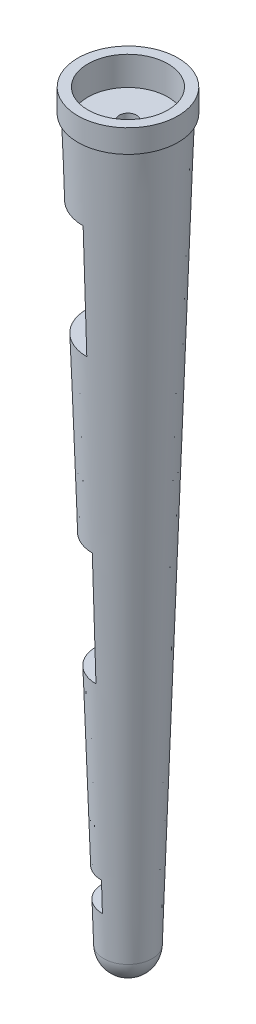
ISO-10303-21;
HEADER;
FILE_DESCRIPTION(('STEP AP214'),'2;1');
FILE_NAME('part.step','',(''),(''),'','','');
FILE_SCHEMA(('AUTOMOTIVE_DESIGN { 1 0 10303 214 1 1 1 1 }'));
ENDSEC;
DATA;
#1=APPLICATION_CONTEXT('core data for automotive mechanical design processes');
#2=APPLICATION_PROTOCOL_DEFINITION('international standard','automotive_design',2000,#1);
#3=PRODUCT_CONTEXT('',#1,'mechanical');
#4=PRODUCT('Part','Part','',(#3));
#5=PRODUCT_RELATED_PRODUCT_CATEGORY('part','',(#4));
#6=PRODUCT_DEFINITION_FORMATION('','',#4);
#7=PRODUCT_DEFINITION_CONTEXT('part definition',#1,'design');
#8=PRODUCT_DEFINITION('design','',#6,#7);
#9=PRODUCT_DEFINITION_SHAPE('','',#8);
#10=(LENGTH_UNIT() NAMED_UNIT(*) SI_UNIT(.MILLI.,.METRE.));
#11=(NAMED_UNIT(*) PLANE_ANGLE_UNIT() SI_UNIT($,.RADIAN.));
#12=(NAMED_UNIT(*) SI_UNIT($,.STERADIAN.) SOLID_ANGLE_UNIT());
#13=UNCERTAINTY_MEASURE_WITH_UNIT(LENGTH_MEASURE(1.E-05),#10,'distance_accuracy_value','');
#14=(GEOMETRIC_REPRESENTATION_CONTEXT(3) GLOBAL_UNCERTAINTY_ASSIGNED_CONTEXT((#13)) GLOBAL_UNIT_ASSIGNED_CONTEXT((#10,
#11,#12)) REPRESENTATION_CONTEXT('',''));
#15=CARTESIAN_POINT('',(0.,0.,0.));
#16=DIRECTION('',(0.,0.,1.));
#17=DIRECTION('',(1.,0.,0.));
#18=AXIS2_PLACEMENT_3D('',#15,#16,#17);
#19=CARTESIAN_POINT('',(0.,0.,0.));
#20=DIRECTION('',(1.,0.,0.));
#21=DIRECTION('',(0.,0.,-1.));
#22=AXIS2_PLACEMENT_3D('',#19,#20,#21);
#23=PLANE('',#22);
#24=DIRECTION('',(0.,0.,-1.));
#25=VECTOR('',#24,1.);
#26=CARTESIAN_POINT('',(0.,-138.679543165146,0.));
#27=LINE('',#26,#25);
#28=CARTESIAN_POINT('',(0.,-138.679543165146,-1.905));
#29=VERTEX_POINT('',#28);
#30=CARTESIAN_POINT('',(0.,-138.679543165146,-3.65518659359779));
#31=VERTEX_POINT('',#30);
#32=EDGE_CURVE('E205',#29,#31,#27,.T.);
#33=ORIENTED_EDGE('',*,*,#32,.F.);
#34=DIRECTION('',(0.,1.,0.));
#35=VECTOR('',#34,1.);
#36=CARTESIAN_POINT('',(0.,-152.619264469482,-1.905));
#37=LINE('',#36,#35);
#38=CARTESIAN_POINT('',(0.,-132.189046243604,-1.905));
#39=VERTEX_POINT('',#38);
#40=EDGE_CURVE('E373',#29,#39,#37,.T.);
#41=ORIENTED_EDGE('',*,*,#40,.T.);
#42=DIRECTION('',(0.,0.,-1.));
#43=VECTOR('',#42,1.);
#44=CARTESIAN_POINT('',(0.,-132.189046243604,0.));
#45=LINE('',#44,#43);
#46=CARTESIAN_POINT('',(0.,-132.189046243604,-3.65518659359779));
#47=VERTEX_POINT('',#46);
#48=EDGE_CURVE('E208',#39,#47,#45,.T.);
#49=ORIENTED_EDGE('',*,*,#48,.T.);
#50=DIRECTION('',(0.,-1.,0.));
#51=VECTOR('',#50,1.);
#52=CARTESIAN_POINT('',(0.,0.,-3.6551865935978));
#53=LINE('',#52,#51);
#54=EDGE_CURVE('E204',#47,#31,#53,.T.);
#55=ORIENTED_EDGE('',*,*,#54,.T.);
#56=EDGE_LOOP('',(#33,#41,#49,#55));
#57=FACE_BOUND('',#56,.T.);
#58=ADVANCED_FACE('F38',(#57),#23,.F.);
#59=CARTESIAN_POINT('',(0.,0.,0.));
#60=DIRECTION('',(1.,0.,0.));
#61=DIRECTION('',(0.,0.,-1.));
#62=AXIS2_PLACEMENT_3D('',#59,#60,#61);
#63=PLANE('',#62);
#64=DIRECTION('',(0.,0.,-1.));
#65=VECTOR('',#64,1.);
#66=CARTESIAN_POINT('',(0.,-94.0890462436041,0.));
#67=LINE('',#66,#65);
#68=CARTESIAN_POINT('',(0.,-94.0890462436041,-1.905));
#69=VERTEX_POINT('',#68);
#70=CARTESIAN_POINT('',(0.,-94.0890462436041,-3.65518659359779));
#71=VERTEX_POINT('',#70);
#72=EDGE_CURVE('E191',#69,#71,#67,.T.);
#73=ORIENTED_EDGE('',*,*,#72,.F.);
#74=DIRECTION('',(0.,1.,0.));
#75=VECTOR('',#74,1.);
#76=CARTESIAN_POINT('',(0.,-152.619264469482,-1.905));
#77=LINE('',#76,#75);
#78=CARTESIAN_POINT('',(0.,-68.6890462436041,-1.905));
#79=VERTEX_POINT('',#78);
#80=EDGE_CURVE('E367',#69,#79,#77,.T.);
#81=ORIENTED_EDGE('',*,*,#80,.T.);
#82=DIRECTION('',(0.,0.,-1.));
#83=VECTOR('',#82,1.);
#84=CARTESIAN_POINT('',(0.,-68.6890462436041,0.));
#85=LINE('',#84,#83);
#86=CARTESIAN_POINT('',(0.,-68.6890462436041,-3.65518659359779));
#87=VERTEX_POINT('',#86);
#88=EDGE_CURVE('E186',#79,#87,#85,.T.);
#89=ORIENTED_EDGE('',*,*,#88,.T.);
#90=DIRECTION('',(0.,-1.,0.));
#91=VECTOR('',#90,1.);
#92=CARTESIAN_POINT('',(0.,0.,-3.6551865935978));
#93=LINE('',#92,#91);
#94=EDGE_CURVE('E183',#87,#71,#93,.T.);
#95=ORIENTED_EDGE('',*,*,#94,.T.);
#96=EDGE_LOOP('',(#73,#81,#89,#95));
#97=FACE_BOUND('',#96,.T.);
#98=ADVANCED_FACE('F276',(#97),#63,.F.);
#99=CARTESIAN_POINT('',(0.,0.,0.));
#100=DIRECTION('',(1.,0.,0.));
#101=DIRECTION('',(0.,0.,-1.));
#102=AXIS2_PLACEMENT_3D('',#99,#100,#101);
#103=PLANE('',#102);
#104=DIRECTION('',(0.,0.,-1.));
#105=VECTOR('',#104,1.);
#106=CARTESIAN_POINT('',(0.,-30.5890462436041,0.));
#107=LINE('',#106,#105);
#108=CARTESIAN_POINT('',(0.,-30.5890462436041,-1.905));
#109=VERTEX_POINT('',#108);
#110=CARTESIAN_POINT('',(0.,-30.5890462436041,-3.65518659359779));
#111=VERTEX_POINT('',#110);
#112=EDGE_CURVE('E169',#109,#111,#107,.T.);
#113=ORIENTED_EDGE('',*,*,#112,.F.);
#114=DIRECTION('',(0.,1.,0.));
#115=VECTOR('',#114,1.);
#116=CARTESIAN_POINT('',(0.,-152.619264469482,-1.905));
#117=LINE('',#116,#115);
#118=CARTESIAN_POINT('',(0.,-5.18904624360411,-1.905));
#119=VERTEX_POINT('',#118);
#120=EDGE_CURVE('E358',#109,#119,#117,.T.);
#121=ORIENTED_EDGE('',*,*,#120,.T.);
#122=DIRECTION('',(0.,0.,-1.));
#123=VECTOR('',#122,1.);
#124=CARTESIAN_POINT('',(0.,-5.18904624360411,0.));
#125=LINE('',#124,#123);
#126=CARTESIAN_POINT('',(0.,-5.18904624360411,-3.65518659359779));
#127=VERTEX_POINT('',#126);
#128=EDGE_CURVE('E164',#119,#127,#125,.T.);
#129=ORIENTED_EDGE('',*,*,#128,.T.);
#130=DIRECTION('',(0.,-1.,0.));
#131=VECTOR('',#130,1.);
#132=CARTESIAN_POINT('',(0.,0.,-3.65518659359779));
#133=LINE('',#132,#131);
#134=EDGE_CURVE('E173',#127,#111,#133,.T.);
#135=ORIENTED_EDGE('',*,*,#134,.T.);
#136=EDGE_LOOP('',(#113,#121,#129,#135));
#137=FACE_BOUND('',#136,.T.);
#138=ADVANCED_FACE('F281',(#137),#103,.F.);
#139=CARTESIAN_POINT('',(0.,11.3209537563959,0.));
#140=DIRECTION('',(0.,1.,0.));
#141=DIRECTION('',(-1.,0.,0.));
#142=AXIS2_PLACEMENT_3D('',#139,#140,#141);
#143=CONICAL_SURFACE('',#142,10.414,0.0318371302197097);
#144=CARTESIAN_POINT('',(0.,-147.429046243604,0.));
#145=DIRECTION('',(0.,1.,0.));
#146=DIRECTION('',(-1.,0.,0.));
#147=AXIS2_PLACEMENT_3D('',#144,#145,#146);
#148=CIRCLE('',#147,5.35814725324457);
#149=CARTESIAN_POINT('',(5.35814725324455,-147.429046243604,0.));
#150=VERTEX_POINT('',#149);
#151=EDGE_CURVE('E220',#150,#150,#148,.T.);
#152=ORIENTED_EDGE('',*,*,#151,.T.);
#153=EDGE_LOOP('',(#152));
#154=FACE_BOUND('',#153,.T.);
#155=CARTESIAN_POINT('',(0.,11.3209537563959,0.));
#156=DIRECTION('',(0.,1.,0.));
#157=DIRECTION('',(-1.,0.,0.));
#158=AXIS2_PLACEMENT_3D('',#155,#156,#157);
#159=CIRCLE('',#158,10.414);
#160=CARTESIAN_POINT('',(-10.414,11.3209537563959,0.));
#161=VERTEX_POINT('',#160);
#162=EDGE_CURVE('E225',#161,#161,#159,.T.);
#163=ORIENTED_EDGE('',*,*,#162,.F.);
#164=EDGE_LOOP('',(#163));
#165=FACE_BOUND('',#164,.T.);
#166=CARTESIAN_POINT('',(-3.76297765312588,-150.950763753856,-3.65518659359779));
#167=CARTESIAN_POINT('',(-3.83813672114551,-149.257711672612,-3.65518659359779));
#168=CARTESIAN_POINT('',(-3.91222848486919,-147.564612645051,-3.65518659359779));
#169=CARTESIAN_POINT('',(-4.05856806060973,-144.178336752723,-3.65518659359779));
#170=CARTESIAN_POINT('',(-4.1308158746951,-142.485159888046,-3.65518659359779));
#171=CARTESIAN_POINT('',(-4.34912865678696,-137.313159836536,-3.65518659359779));
#172=CARTESIAN_POINT('',(-4.49269216426769,-133.834231026097,-3.65518659359779));
#173=CARTESIAN_POINT('',(-4.70436820435346,-128.615685690882,-3.65518659359779));
#174=CARTESIAN_POINT('',(-4.77431543269389,-126.876143050672,-3.65518659359779));
#175=CARTESIAN_POINT('',(-4.91312686687736,-123.397015024012,-3.65518659359779));
#176=CARTESIAN_POINT('',(-4.98199107301823,-121.657429637574,-3.65518659359779));
#177=CARTESIAN_POINT('',(-5.05038384531122,-119.917825654894,-3.65518659359779));
#178=B_SPLINE_CURVE_WITH_KNOTS('',3,(#166,#167,#168,#169,#170,#171,#172,#173,#174,#175,#176,
#177),.UNSPECIFIED.,.F.,.F.,(4,2,2,2,2,4),(0.,5.0841575410137,10.1683093784881,20.6139730538796,
25.8368179528393,31.0596614155634),.UNSPECIFIED.);
#179=CARTESIAN_POINT('',(-4.29105238565613,-138.679543165146,-3.65518659359779));
#180=VERTEX_POINT('',#179);
#181=CARTESIAN_POINT('',(-4.55918959527502,-132.189046243604,-3.65518659359779));
#182=VERTEX_POINT('',#181);
#183=EDGE_CURVE('E233',#180,#182,#178,.T.);
#184=ORIENTED_EDGE('',*,*,#183,.T.);
#185=CARTESIAN_POINT('',(0.,-132.189046243604,0.));
#186=DIRECTION('',(0.,-1.,0.));
#187=DIRECTION('',(0.,0.,-1.));
#188=AXIS2_PLACEMENT_3D('',#185,#186,#187);
#189=CIRCLE('',#188,5.84350911693309);
#190=CARTESIAN_POINT('',(0.,-132.189046243604,5.84350911693309));
#191=VERTEX_POINT('',#190);
#192=EDGE_CURVE('E241',#182,#191,#189,.F.);
#193=ORIENTED_EDGE('',*,*,#192,.T.);
#194=DIRECTION('',(0.,-0.999493241376189,-0.0318317521245688));
#195=VECTOR('',#194,1.);
#196=CARTESIAN_POINT('',(0.,-315.6708679617,0.));
#197=LINE('',#196,#195);
#198=CARTESIAN_POINT('',(0.,-138.679543165146,5.63680047637508));
#199=VERTEX_POINT('',#198);
#200=EDGE_CURVE('E228',#199,#191,#197,.F.);
#201=ORIENTED_EDGE('',*,*,#200,.F.);
#202=CARTESIAN_POINT('',(0.,-138.679543165146,0.));
#203=DIRECTION('',(0.,-1.,0.));
#204=DIRECTION('',(0.,0.,-1.));
#205=AXIS2_PLACEMENT_3D('',#202,#203,#204);
#206=CIRCLE('',#205,5.63680047637508);
#207=EDGE_CURVE('E230',#180,#199,#206,.F.);
#208=ORIENTED_EDGE('',*,*,#207,.F.);
#209=EDGE_LOOP('',(#184,#193,#201,#208));
#210=FACE_BOUND('',#209,.T.);
#211=CARTESIAN_POINT('',(0.,-94.0890462436041,0.));
#212=DIRECTION('',(0.,-1.,0.));
#213=DIRECTION('',(0.,0.,-1.));
#214=AXIS2_PLACEMENT_3D('',#211,#212,#213);
#215=CIRCLE('',#214,7.05691377615439);
#216=CARTESIAN_POINT('',(-6.03652574003131,-94.0890462436041,-3.65518659359779));
#217=VERTEX_POINT('',#216);
#218=CARTESIAN_POINT('',(0.,-94.0890462436041,7.05691377615439));
#219=VERTEX_POINT('',#218);
#220=EDGE_CURVE('E313',#217,#219,#215,.F.);
#221=ORIENTED_EDGE('',*,*,#220,.F.);
#222=CARTESIAN_POINT('',(-4.98642119576789,-121.541229705642,-3.65518659359779));
#223=CARTESIAN_POINT('',(-5.06522459670013,-119.545488370762,-3.65518659359779));
#224=CARTESIAN_POINT('',(-5.14338512888148,-117.549721768195,-3.65518659359779));
#225=CARTESIAN_POINT('',(-5.29856761974877,-113.558144726367,-3.65518659359779));
#226=CARTESIAN_POINT('',(-5.37558957868659,-111.562334287117,-3.65518659359779));
#227=CARTESIAN_POINT('',(-5.6051685401313,-105.574842110261,-3.65518659359779));
#228=CARTESIAN_POINT('',(-5.75623847670861,-101.58310334091,-3.65518659359779));
#229=CARTESIAN_POINT('',(-6.05525314475554,-93.5995086490794,-3.65518659359779));
#230=CARTESIAN_POINT('',(-6.20319787590209,-89.6076527265868,-3.65518659359779));
#231=CARTESIAN_POINT('',(-6.64329137148165,-77.6319437326436,-3.65518659359779));
#232=CARTESIAN_POINT('',(-6.93169929655081,-69.6479531585042,-3.65518659359779));
#233=CARTESIAN_POINT('',(-7.33825397444553,-58.2593847624802,-3.65518659359779));
#234=CARTESIAN_POINT('',(-7.45917209920785,-54.8549052070016,-3.65518659359779));
#235=CARTESIAN_POINT('',(-7.6999249137618,-48.0459101867494,-3.65518659359779));
#236=CARTESIAN_POINT('',(-7.81975960431834,-44.6413947220027,-3.65518659359779));
#237=CARTESIAN_POINT('',(-7.93912681543483,-41.2368627815662,-3.65518659359779));
#238=B_SPLINE_CURVE_WITH_KNOTS('',3,(#222,#223,#224,#225,#226,#227,#228,#229,#230,#231,#232,
#233,#234,#235,#236,#237),.UNSPECIFIED.,.F.,.F.,(4,2,2,2,2,2,2,4),(0.,5.99188932305257,
11.9837773205002,23.9675648063484,35.9513535310251,59.9189421597625,70.1388207893392,
80.3586922032133),.UNSPECIFIED.);
#239=CARTESIAN_POINT('',(-6.96499896488091,-68.6890462436041,-3.65518659359779));
#240=VERTEX_POINT('',#239);
#241=EDGE_CURVE('E318',#217,#240,#238,.T.);
#242=ORIENTED_EDGE('',*,*,#241,.T.);
#243=CARTESIAN_POINT('',(0.,-68.6890462436041,0.));
#244=DIRECTION('',(0.,-1.,0.));
#245=DIRECTION('',(0.,0.,-1.));
#246=AXIS2_PLACEMENT_3D('',#243,#244,#245);
#247=CIRCLE('',#246,7.86585021563526);
#248=CARTESIAN_POINT('',(0.,-68.6890462436041,7.86585021563526));
#249=VERTEX_POINT('',#248);
#250=EDGE_CURVE('E308',#240,#249,#247,.F.);
#251=ORIENTED_EDGE('',*,*,#250,.T.);
#252=DIRECTION('',(0.,-0.999493241376189,-0.0318317521245688));
#253=VECTOR('',#252,1.);
#254=CARTESIAN_POINT('',(0.,-315.6708679617,0.));
#255=LINE('',#254,#253);
#256=EDGE_CURVE('E307',#219,#249,#255,.F.);
#257=ORIENTED_EDGE('',*,*,#256,.F.);
#258=EDGE_LOOP('',(#221,#242,#251,#257));
#259=FACE_BOUND('',#258,.T.);
#260=CARTESIAN_POINT('',(0.,-30.5890462436041,0.));
#261=DIRECTION('',(0.,-1.,0.));
#262=DIRECTION('',(0.,0.,-1.));
#263=AXIS2_PLACEMENT_3D('',#260,#261,#262);
#264=CIRCLE('',#263,9.07925487485656);
#265=CARTESIAN_POINT('',(-8.31098550405363,-30.5890462436041,-3.65518659359779));
#266=VERTEX_POINT('',#265);
#267=CARTESIAN_POINT('',(0.,-30.5890462436041,9.07925487485656));
#268=VERTEX_POINT('',#267);
#269=EDGE_CURVE('E47',#266,#268,#264,.F.);
#270=ORIENTED_EDGE('',*,*,#269,.F.);
#271=CARTESIAN_POINT('',(-7.3458145480753,-58.041229705642,-3.65518659359779));
#272=CARTESIAN_POINT('',(-7.44004293919151,-55.3922916495875,-3.65518659359779));
#273=CARTESIAN_POINT('',(-7.53391530327361,-52.7433409532208,-3.65518659359779));
#274=CARTESIAN_POINT('',(-7.72101705916545,-47.4454170739312,-3.65518659359779));
#275=CARTESIAN_POINT('',(-7.81424645102936,-44.7964438910101,-3.65518659359779));
#276=CARTESIAN_POINT('',(-8.09551070072181,-36.780039649243,-3.65518659359779));
#277=CARTESIAN_POINT('',(-8.28265445618378,-31.412577319073,-3.65518659359779));
#278=CARTESIAN_POINT('',(-8.65502471639328,-20.6775860460334,-3.65518659359779));
#279=CARTESIAN_POINT('',(-8.84025122107827,-15.3100571031616,-3.65518659359779));
#280=CARTESIAN_POINT('',(-9.20912105506264,-4.57494293087607,-3.65518659359779));
#281=CARTESIAN_POINT('',(-9.39276438379737,0.792642298557135,-3.65518659359779));
#282=CARTESIAN_POINT('',(-9.75871407251338,11.5278579584123,-3.65518659359779));
#283=CARTESIAN_POINT('',(-9.94102043259037,16.8954883888311,-3.65518659359779));
#284=CARTESIAN_POINT('',(-10.1227814582309,22.2631372184337,-3.65518659359779));
#285=B_SPLINE_CURVE_WITH_KNOTS('',3,(#271,#272,#273,#274,#275,#276,#277,#278,#279,#280,#281,
#282,#283,#284),.UNSPECIFIED.,.F.,.F.,(4,2,2,2,2,2,4),(0.,7.95184037443213,15.9036800788281,
32.015851152585,48.1280227518889,64.2402000974354,80.3523762892752),.UNSPECIFIED.);
#286=CARTESIAN_POINT('',(-9.18781467134167,-5.18904624360411,-3.65518659359779));
#287=VERTEX_POINT('',#286);
#288=EDGE_CURVE('E11',#266,#287,#285,.T.);
#289=ORIENTED_EDGE('',*,*,#288,.T.);
#290=CARTESIAN_POINT('',(0.,-5.18904624360411,0.));
#291=DIRECTION('',(0.,-1.,0.));
#292=DIRECTION('',(0.,0.,-1.));
#293=AXIS2_PLACEMENT_3D('',#290,#291,#292);
#294=CIRCLE('',#293,9.88819131433743);
#295=CARTESIAN_POINT('',(0.,-5.18904624360411,9.88819131433743));
#296=VERTEX_POINT('',#295);
#297=EDGE_CURVE('E349',#287,#296,#294,.F.);
#298=ORIENTED_EDGE('',*,*,#297,.T.);
#299=DIRECTION('',(0.,-0.999493241376189,-0.0318317521245688));
#300=VECTOR('',#299,1.);
#301=CARTESIAN_POINT('',(0.,-315.6708679617,0.));
#302=LINE('',#301,#300);
#303=EDGE_CURVE('E168',#268,#296,#302,.F.);
#304=ORIENTED_EDGE('',*,*,#303,.F.);
#305=EDGE_LOOP('',(#270,#289,#298,#304));
#306=FACE_BOUND('',#305,.T.);
#307=ADVANCED_FACE('F243',(#154,#165,#210,#259,#306),#143,.T.);
#308=CARTESIAN_POINT('',(0.,-147.258400552216,0.));
#309=DIRECTION('',(0.,1.,0.));
#310=DIRECTION('',(1.,0.,0.));
#311=AXIS2_PLACEMENT_3D('',#308,#309,#310);
#312=SPHERICAL_SURFACE('',#311,5.3608639172657);
#313=CARTESIAN_POINT('',(0.,-152.269372208436,0.));
#314=DIRECTION('',(0.,0.999999999999999,0.));
#315=DIRECTION('',(0.,0.,1.));
#316=AXIS2_PLACEMENT_3D('',#313,#314,#315);
#317=CIRCLE('',#316,1.905);
#318=CARTESIAN_POINT('',(1.90499999999998,-152.269372208436,0.));
#319=VERTEX_POINT('',#318);
#320=EDGE_CURVE('E376',#319,#319,#317,.T.);
#321=CARTESIAN_POINT('',(1.90499999999998,-152.269372208436,0.));
#322=CARTESIAN_POINT('',(1.9663672649229,-152.246043098662,0.));
#323=CARTESIAN_POINT('',(2.02730552628049,-152.221585629138,0.));
#324=CARTESIAN_POINT('',(2.14824279651466,-152.170449344007,0.));
#325=CARTESIAN_POINT('',(2.20824180539123,-152.1437705284,0.));
#326=CARTESIAN_POINT('',(2.32721932531301,-152.088226924519,0.));
#327=CARTESIAN_POINT('',(2.38619783635821,-152.059362136244,0.));
#328=CARTESIAN_POINT('',(2.50305483224659,-151.999485714055,0.));
#329=CARTESIAN_POINT('',(2.56093331708977,-151.96847408014,0.));
#330=CARTESIAN_POINT('',(2.67551212583634,-151.904345775931,0.));
#331=CARTESIAN_POINT('',(2.73221244973973,-151.871229105637,0.));
#332=CARTESIAN_POINT('',(2.844358416357,-151.802935436661,0.));
#333=CARTESIAN_POINT('',(2.89980405907088,-151.76775843798,0.));
#334=CARTESIAN_POINT('',(3.00936582990124,-151.695391585483,0.));
#335=CARTESIAN_POINT('',(3.06348195801771,-151.658201731667,0.));
#336=CARTESIAN_POINT('',(3.17031166237119,-151.581859362939,0.));
#337=CARTESIAN_POINT('',(3.22302523860819,-151.542706848027,0.));
#338=CARTESIAN_POINT('',(3.32697869440099,-151.462491998932,0.));
#339=CARTESIAN_POINT('',(3.37821857395679,-151.42142966475,0.));
#340=CARTESIAN_POINT('',(3.47915548068098,-151.337450596821,0.));
#341=CARTESIAN_POINT('',(3.52885250784937,-151.294533863075,0.));
#342=CARTESIAN_POINT('',(3.62663663636442,-151.206903918427,0.));
#343=CARTESIAN_POINT('',(3.67472373771109,-151.162190707526,0.));
#344=CARTESIAN_POINT('',(3.76922311398844,-151.07102815561,0.));
#345=CARTESIAN_POINT('',(3.81563538891913,-151.024578814595,0.));
#346=CARTESIAN_POINT('',(3.90672247219175,-150.930006692649,0.));
#347=CARTESIAN_POINT('',(3.95139728053368,-150.881883911717,0.));
#348=CARTESIAN_POINT('',(4.03894913542263,-150.784029858689,0.));
#349=CARTESIAN_POINT('',(4.08182618196965,-150.734298586592,0.));
#350=CARTESIAN_POINT('',(4.1657246444057,-150.633294670878,0.));
#351=CARTESIAN_POINT('',(4.20674606029473,-150.582022027262,0.));
#352=CARTESIAN_POINT('',(4.28687789699747,-150.478004568462,0.));
#353=CARTESIAN_POINT('',(4.32598831781119,-150.425259753278,0.));
#354=CARTESIAN_POINT('',(4.40224537911412,-150.318369138208,0.));
#355=CARTESIAN_POINT('',(4.43939201960334,-150.264223338322,0.));
#356=CARTESIAN_POINT('',(4.51167138541767,-150.154603831544,0.));
#357=CARTESIAN_POINT('',(4.54680411074279,-150.099130124654,0.));
#358=CARTESIAN_POINT('',(4.61500822946318,-149.986929673772,0.));
#359=CARTESIAN_POINT('',(4.64807962285846,-149.93020292978,0.));
#360=CARTESIAN_POINT('',(4.71211644302332,-149.815572965758,0.));
#361=CARTESIAN_POINT('',(4.7430818697929,-149.757669745727,0.));
#362=CARTESIAN_POINT('',(4.80286496432092,-149.640764978513,0.));
#363=CARTESIAN_POINT('',(4.83168263207937,-149.581763431331,0.));
#364=CARTESIAN_POINT('',(4.88713131491711,-149.462741641056,0.));
#365=CARTESIAN_POINT('',(4.91376232999641,-149.402721397964,0.));
#366=CARTESIAN_POINT('',(4.96480176501018,-149.28174322199,0.));
#367=CARTESIAN_POINT('',(4.98921018494466,-149.220785289109,0.));
#368=CARTESIAN_POINT('',(5.03577148694436,-149.09801400523,0.));
#369=CARTESIAN_POINT('',(5.05792436900957,-149.036200654232,0.));
#370=CARTESIAN_POINT('',(5.0999446966392,-148.911801960299,0.));
#371=CARTESIAN_POINT('',(5.11981214220362,-148.849216617363,0.));
#372=CARTESIAN_POINT('',(5.15723478305389,-148.72335840767,0.));
#373=CARTESIAN_POINT('',(5.17478997833975,-148.660085540913,0.));
#374=CARTESIAN_POINT('',(5.2075644243742,-148.532937679527,0.));
#375=CARTESIAN_POINT('',(5.22278367512279,-148.469062684899,0.));
#376=CARTESIAN_POINT('',(5.2508656950091,-148.340796776685,0.));
#377=CARTESIAN_POINT('',(5.26372846414681,-148.276405863101,0.));
#378=CARTESIAN_POINT('',(5.28708014741584,-148.147195021052,0.));
#379=CARTESIAN_POINT('',(5.29756906154715,-148.082375092587,0.));
#380=CARTESIAN_POINT('',(5.31615892774587,-147.952393708163,0.));
#381=CARTESIAN_POINT('',(5.32425987981329,-147.887232252203,0.));
#382=CARTESIAN_POINT('',(5.33806270458113,-147.756655745099,0.));
#383=CARTESIAN_POINT('',(5.34376457728157,-147.691240693956,0.));
#384=CARTESIAN_POINT('',(5.35276223405187,-147.560245330827,0.));
#385=CARTESIAN_POINT('',(5.35605801812174,-147.494665018841,0.));
#386=CARTESIAN_POINT('',(5.35814725324455,-147.429046243604,0.));
#387=B_SPLINE_CURVE_WITH_KNOTS('',3,(#321,#322,#323,#324,#325,#326,#327,#328,#329,#330,#331,
#332,#333,#334,#335,#336,#337,#338,#339,#340,#341,#342,#343,#344,#345,#346,#347,#348,#349,#350,
#351,#352,#353,#354,#355,#356,#357,#358,#359,#360,#361,#362,#363,#364,#365,#366,#367,#368,#369,
#370,#371,#372,#373,#374,#375,#376,#377,#378,#379,#380,#381,#382,#383,#384,#385,#386),
.UNSPECIFIED.,.F.,.F.,(4,2,2,2,2,2,2,2,2,2,2,2,2,2,2,2,2,2,2,2,2,2,2,2,2,2,2,2,2,2,2,2,4),(0.,
0.196944939753012,0.393889879506019,0.590834819259035,0.78777975901204,0.984724698765043,
1.18166963851806,1.37861457827106,1.57555951802408,1.77250445777709,1.96944939753008,
2.1663943372831,2.3633392770361,2.56028421678911,2.75722915654212,2.95417409629513,
3.15111903604813,3.34806397580114,3.54500891555416,3.74195385530715,3.93889879506018,
4.13584373481317,4.33278867456619,4.52973361431918,4.72667855407219,4.9236234938252,
5.12056843357821,5.31751337333122,5.51445831308422,5.71140325283725,5.90834819259026,
6.10529313234326,6.30223807209628),.UNSPECIFIED.);
#388=EDGE_CURVE('BSEAM40',#319,#150,#387,.T.);
#389=ORIENTED_EDGE('',*,*,#320,.T.);
#390=ORIENTED_EDGE('',*,*,#151,.F.);
#391=ORIENTED_EDGE('',*,*,#388,.T.);
#392=ORIENTED_EDGE('',*,*,#388,.F.);
#393=EDGE_LOOP('',(#389,#391,#390,#392));
#394=FACE_BOUND('',#393,.T.);
#395=ADVANCED_FACE('F40',(#394),#312,.T.);
#396=CARTESIAN_POINT('',(0.,16.4009537563959,0.));
#397=DIRECTION('',(0.,-1.,0.));
#398=DIRECTION('',(1.,0.,0.));
#399=AXIS2_PLACEMENT_3D('',#396,#397,#398);
#400=CYLINDRICAL_SURFACE('',#399,11.049);
#401=CARTESIAN_POINT('',(0.,16.4009537563959,0.));
#402=DIRECTION('',(0.,1.,0.));
#403=DIRECTION('',(0.,0.,1.));
#404=AXIS2_PLACEMENT_3D('',#401,#402,#403);
#405=CIRCLE('',#404,11.049);
#406=CARTESIAN_POINT('',(0.,16.4009537563959,11.049));
#407=VERTEX_POINT('',#406);
#408=EDGE_CURVE('E217',#407,#407,#405,.T.);
#409=ORIENTED_EDGE('',*,*,#408,.F.);
#410=EDGE_LOOP('',(#409));
#411=FACE_BOUND('',#410,.T.);
#412=CARTESIAN_POINT('',(0.,11.3209537563959,0.));
#413=DIRECTION('',(0.,1.,0.));
#414=DIRECTION('',(0.,0.,1.));
#415=AXIS2_PLACEMENT_3D('',#412,#413,#414);
#416=CIRCLE('',#415,11.049);
#417=CARTESIAN_POINT('',(0.,11.3209537563959,11.049));
#418=VERTEX_POINT('',#417);
#419=EDGE_CURVE('E181',#418,#418,#416,.T.);
#420=ORIENTED_EDGE('',*,*,#419,.T.);
#421=EDGE_LOOP('',(#420));
#422=FACE_BOUND('',#421,.T.);
#423=ADVANCED_FACE('F263',(#411,#422),#400,.T.);
#424=CARTESIAN_POINT('',(0.,16.4009537563959,0.));
#425=DIRECTION('',(0.,1.,0.));
#426=DIRECTION('',(0.,0.,1.));
#427=AXIS2_PLACEMENT_3D('',#424,#425,#426);
#428=PLANE('',#427);
#429=CARTESIAN_POINT('',(0.,16.4009537563959,0.));
#430=DIRECTION('',(0.,1.,0.));
#431=DIRECTION('',(0.,0.,1.));
#432=AXIS2_PLACEMENT_3D('',#429,#430,#431);
#433=CIRCLE('',#432,8.8265);
#434=CARTESIAN_POINT('',(0.,16.4009537563959,8.8265));
#435=VERTEX_POINT('',#434);
#436=EDGE_CURVE('E379',#435,#435,#433,.T.);
#437=ORIENTED_EDGE('',*,*,#436,.F.);
#438=EDGE_LOOP('',(#437));
#439=FACE_BOUND('',#438,.T.);
#440=ORIENTED_EDGE('',*,*,#408,.T.);
#441=EDGE_LOOP('',(#440));
#442=FACE_BOUND('',#441,.T.);
#443=ADVANCED_FACE('F259',(#439,#442),#428,.T.);
#444=CARTESIAN_POINT('',(0.,11.3209537563959,0.));
#445=DIRECTION('',(0.,1.,0.));
#446=DIRECTION('',(0.,0.,1.));
#447=AXIS2_PLACEMENT_3D('',#444,#445,#446);
#448=PLANE('',#447);
#449=ORIENTED_EDGE('',*,*,#162,.T.);
#450=EDGE_LOOP('',(#449));
#451=FACE_BOUND('',#450,.T.);
#452=ORIENTED_EDGE('',*,*,#419,.F.);
#453=EDGE_LOOP('',(#452));
#454=FACE_BOUND('',#453,.T.);
#455=ADVANCED_FACE('F262',(#451,#454),#448,.F.);
#456=CARTESIAN_POINT('',(-11.049,-132.189046243604,0.));
#457=DIRECTION('',(0.,-1.,0.));
#458=DIRECTION('',(0.,0.,-1.));
#459=AXIS2_PLACEMENT_3D('',#456,#457,#458);
#460=PLANE('',#459);
#461=CARTESIAN_POINT('',(0.,-132.189046243604,0.));
#462=DIRECTION('',(0.,-1.,0.));
#463=DIRECTION('',(0.,0.,-1.));
#464=AXIS2_PLACEMENT_3D('',#461,#462,#463);
#465=CIRCLE('',#464,1.905);
#466=CARTESIAN_POINT('',(0.,-132.189046243604,1.905));
#467=VERTEX_POINT('',#466);
#468=EDGE_CURVE('E303',#467,#39,#465,.T.);
#469=ORIENTED_EDGE('',*,*,#468,.F.);
#470=EDGE_CURVE('E209',#191,#467,#45,.T.);
#471=ORIENTED_EDGE('',*,*,#470,.F.);
#472=ORIENTED_EDGE('',*,*,#192,.F.);
#473=DIRECTION('',(1.,0.,0.));
#474=VECTOR('',#473,1.);
#475=CARTESIAN_POINT('',(-11.049,-132.189046243604,-3.65518659359779));
#476=LINE('',#475,#474);
#477=EDGE_CURVE('E187',#182,#47,#476,.T.);
#478=ORIENTED_EDGE('',*,*,#477,.T.);
#479=ORIENTED_EDGE('',*,*,#48,.F.);
#480=EDGE_LOOP('',(#469,#471,#472,#478,#479));
#481=FACE_BOUND('',#480,.T.);
#482=ADVANCED_FACE('F252',(#481),#460,.T.);
#483=CARTESIAN_POINT('',(-11.049,0.,-3.6551865935978));
#484=DIRECTION('',(0.,0.,1.));
#485=DIRECTION('',(0.,-1.,0.));
#486=AXIS2_PLACEMENT_3D('',#483,#484,#485);
#487=PLANE('',#486);
#488=DIRECTION('',(1.,0.,0.));
#489=VECTOR('',#488,1.);
#490=CARTESIAN_POINT('',(-11.049,-138.679543165146,-3.65518659359779));
#491=LINE('',#490,#489);
#492=EDGE_CURVE('E212',#180,#31,#491,.T.);
#493=ORIENTED_EDGE('',*,*,#492,.T.);
#494=ORIENTED_EDGE('',*,*,#54,.F.);
#495=ORIENTED_EDGE('',*,*,#477,.F.);
#496=ORIENTED_EDGE('',*,*,#183,.F.);
#497=EDGE_LOOP('',(#493,#494,#495,#496));
#498=FACE_BOUND('',#497,.T.);
#499=ADVANCED_FACE('F246',(#498),#487,.T.);
#500=CARTESIAN_POINT('',(-11.049,-138.679543165146,0.));
#501=DIRECTION('',(0.,-1.,0.));
#502=DIRECTION('',(0.,0.,-1.));
#503=AXIS2_PLACEMENT_3D('',#500,#501,#502);
#504=PLANE('',#503);
#505=CARTESIAN_POINT('',(0.,-138.679543165146,1.905));
#506=VERTEX_POINT('',#505);
#507=EDGE_CURVE('E201',#199,#506,#27,.T.);
#508=ORIENTED_EDGE('',*,*,#507,.T.);
#509=CARTESIAN_POINT('',(0.,-138.679543165146,0.));
#510=DIRECTION('',(0.,-1.,0.));
#511=DIRECTION('',(0.,0.,-1.));
#512=AXIS2_PLACEMENT_3D('',#509,#510,#511);
#513=CIRCLE('',#512,1.905);
#514=EDGE_CURVE('E54',#506,#29,#513,.T.);
#515=ORIENTED_EDGE('',*,*,#514,.T.);
#516=ORIENTED_EDGE('',*,*,#32,.T.);
#517=ORIENTED_EDGE('',*,*,#492,.F.);
#518=ORIENTED_EDGE('',*,*,#207,.T.);
#519=EDGE_LOOP('',(#508,#515,#516,#517,#518));
#520=FACE_BOUND('',#519,.T.);
#521=ADVANCED_FACE('F251',(#520),#504,.F.);
#522=ORIENTED_EDGE('',*,*,#470,.T.);
#523=DIRECTION('',(0.,1.,0.));
#524=VECTOR('',#523,1.);
#525=CARTESIAN_POINT('',(0.,-152.619264469482,1.905));
#526=LINE('',#525,#524);
#527=EDGE_CURVE('E296',#467,#506,#526,.F.);
#528=ORIENTED_EDGE('',*,*,#527,.T.);
#529=ORIENTED_EDGE('',*,*,#507,.F.);
#530=ORIENTED_EDGE('',*,*,#200,.T.);
#531=EDGE_LOOP('',(#522,#528,#529,#530));
#532=FACE_BOUND('',#531,.T.);
#533=ADVANCED_FACE('F257',(#532),#23,.F.);
#534=CARTESIAN_POINT('',(-11.049,0.,-3.6551865935978));
#535=DIRECTION('',(0.,0.,1.));
#536=DIRECTION('',(0.,-1.,0.));
#537=AXIS2_PLACEMENT_3D('',#534,#535,#536);
#538=PLANE('',#537);
#539=DIRECTION('',(1.,0.,0.));
#540=VECTOR('',#539,1.);
#541=CARTESIAN_POINT('',(-11.049,-94.0890462436041,-3.65518659359779));
#542=LINE('',#541,#540);
#543=EDGE_CURVE('E196',#217,#71,#542,.T.);
#544=ORIENTED_EDGE('',*,*,#543,.T.);
#545=ORIENTED_EDGE('',*,*,#94,.F.);
#546=DIRECTION('',(1.,0.,0.));
#547=VECTOR('',#546,1.);
#548=CARTESIAN_POINT('',(-11.049,-68.6890462436041,-3.65518659359779));
#549=LINE('',#548,#547);
#550=EDGE_CURVE('E195',#240,#87,#549,.T.);
#551=ORIENTED_EDGE('',*,*,#550,.F.);
#552=ORIENTED_EDGE('',*,*,#241,.F.);
#553=EDGE_LOOP('',(#544,#545,#551,#552));
#554=FACE_BOUND('',#553,.T.);
#555=ADVANCED_FACE('F288',(#554),#538,.T.);
#556=CARTESIAN_POINT('',(-11.049,-94.0890462436041,0.));
#557=DIRECTION('',(0.,-1.,0.));
#558=DIRECTION('',(0.,0.,-1.));
#559=AXIS2_PLACEMENT_3D('',#556,#557,#558);
#560=PLANE('',#559);
#561=CARTESIAN_POINT('',(0.,-94.0890462436041,1.905));
#562=VERTEX_POINT('',#561);
#563=EDGE_CURVE('E192',#219,#562,#67,.T.);
#564=ORIENTED_EDGE('',*,*,#563,.T.);
#565=CARTESIAN_POINT('',(0.,-94.0890462436041,0.));
#566=DIRECTION('',(0.,-1.,0.));
#567=DIRECTION('',(0.,0.,-1.));
#568=AXIS2_PLACEMENT_3D('',#565,#566,#567);
#569=CIRCLE('',#568,1.905);
#570=EDGE_CURVE('E62',#562,#69,#569,.T.);
#571=ORIENTED_EDGE('',*,*,#570,.T.);
#572=ORIENTED_EDGE('',*,*,#72,.T.);
#573=ORIENTED_EDGE('',*,*,#543,.F.);
#574=ORIENTED_EDGE('',*,*,#220,.T.);
#575=EDGE_LOOP('',(#564,#571,#572,#573,#574));
#576=FACE_BOUND('',#575,.T.);
#577=ADVANCED_FACE('F293',(#576),#560,.F.);
#578=CARTESIAN_POINT('',(-11.049,-68.6890462436041,0.));
#579=DIRECTION('',(0.,-1.,0.));
#580=DIRECTION('',(0.,0.,-1.));
#581=AXIS2_PLACEMENT_3D('',#578,#579,#580);
#582=PLANE('',#581);
#583=CARTESIAN_POINT('',(0.,-68.6890462436041,0.));
#584=DIRECTION('',(0.,-1.,0.));
#585=DIRECTION('',(0.,0.,-1.));
#586=AXIS2_PLACEMENT_3D('',#583,#584,#585);
#587=CIRCLE('',#586,1.905);
#588=CARTESIAN_POINT('',(0.,-68.6890462436041,1.905));
#589=VERTEX_POINT('',#588);
#590=EDGE_CURVE('E361',#589,#79,#587,.T.);
#591=ORIENTED_EDGE('',*,*,#590,.F.);
#592=EDGE_CURVE('E188',#249,#589,#85,.T.);
#593=ORIENTED_EDGE('',*,*,#592,.F.);
#594=ORIENTED_EDGE('',*,*,#250,.F.);
#595=ORIENTED_EDGE('',*,*,#550,.T.);
#596=ORIENTED_EDGE('',*,*,#88,.F.);
#597=EDGE_LOOP('',(#591,#593,#594,#595,#596));
#598=FACE_BOUND('',#597,.T.);
#599=ADVANCED_FACE('F328',(#598),#582,.T.);
#600=ORIENTED_EDGE('',*,*,#592,.T.);
#601=DIRECTION('',(0.,1.,0.));
#602=VECTOR('',#601,1.);
#603=CARTESIAN_POINT('',(0.,-152.619264469482,1.905));
#604=LINE('',#603,#602);
#605=EDGE_CURVE('E359',#589,#562,#604,.F.);
#606=ORIENTED_EDGE('',*,*,#605,.T.);
#607=ORIENTED_EDGE('',*,*,#563,.F.);
#608=ORIENTED_EDGE('',*,*,#256,.T.);
#609=EDGE_LOOP('',(#600,#606,#607,#608));
#610=FACE_BOUND('',#609,.T.);
#611=ADVANCED_FACE('F284',(#610),#63,.F.);
#612=CARTESIAN_POINT('',(-11.049,0.,-3.65518659359779));
#613=DIRECTION('',(0.,0.,1.));
#614=DIRECTION('',(0.,-1.,0.));
#615=AXIS2_PLACEMENT_3D('',#612,#613,#614);
#616=PLANE('',#615);
#617=DIRECTION('',(1.,0.,0.));
#618=VECTOR('',#617,1.);
#619=CARTESIAN_POINT('',(-11.049,-30.5890462436041,-3.65518659359779));
#620=LINE('',#619,#618);
#621=EDGE_CURVE('E178',#266,#111,#620,.T.);
#622=ORIENTED_EDGE('',*,*,#621,.T.);
#623=ORIENTED_EDGE('',*,*,#134,.F.);
#624=DIRECTION('',(1.,0.,0.));
#625=VECTOR('',#624,1.);
#626=CARTESIAN_POINT('',(-11.049,-5.18904624360411,-3.65518659359779));
#627=LINE('',#626,#625);
#628=EDGE_CURVE('E177',#287,#127,#627,.T.);
#629=ORIENTED_EDGE('',*,*,#628,.F.);
#630=ORIENTED_EDGE('',*,*,#288,.F.);
#631=EDGE_LOOP('',(#622,#623,#629,#630));
#632=FACE_BOUND('',#631,.T.);
#633=ADVANCED_FACE('F336',(#632),#616,.T.);
#634=CARTESIAN_POINT('',(-11.049,-30.5890462436041,0.));
#635=DIRECTION('',(0.,-1.,0.));
#636=DIRECTION('',(0.,0.,-1.));
#637=AXIS2_PLACEMENT_3D('',#634,#635,#636);
#638=PLANE('',#637);
#639=CARTESIAN_POINT('',(0.,-30.5890462436041,1.905));
#640=VERTEX_POINT('',#639);
#641=EDGE_CURVE('E171',#268,#640,#107,.T.);
#642=ORIENTED_EDGE('',*,*,#641,.T.);
#643=CARTESIAN_POINT('',(0.,-30.5890462436041,0.));
#644=DIRECTION('',(0.,-1.,0.));
#645=DIRECTION('',(0.,0.,-1.));
#646=AXIS2_PLACEMENT_3D('',#643,#644,#645);
#647=CIRCLE('',#646,1.905);
#648=EDGE_CURVE('E152',#640,#109,#647,.T.);
#649=ORIENTED_EDGE('',*,*,#648,.T.);
#650=ORIENTED_EDGE('',*,*,#112,.T.);
#651=ORIENTED_EDGE('',*,*,#621,.F.);
#652=ORIENTED_EDGE('',*,*,#269,.T.);
#653=EDGE_LOOP('',(#642,#649,#650,#651,#652));
#654=FACE_BOUND('',#653,.T.);
#655=ADVANCED_FACE('F340',(#654),#638,.F.);
#656=CARTESIAN_POINT('',(-11.049,-5.18904624360411,0.));
#657=DIRECTION('',(0.,-1.,0.));
#658=DIRECTION('',(0.,0.,-1.));
#659=AXIS2_PLACEMENT_3D('',#656,#657,#658);
#660=PLANE('',#659);
#661=CARTESIAN_POINT('',(0.,-5.18904624360411,0.));
#662=DIRECTION('',(0.,-1.,0.));
#663=DIRECTION('',(0.,0.,-1.));
#664=AXIS2_PLACEMENT_3D('',#661,#662,#663);
#665=CIRCLE('',#664,1.905);
#666=CARTESIAN_POINT('',(0.,-5.18904624360411,1.905));
#667=VERTEX_POINT('',#666);
#668=EDGE_CURVE('E149',#667,#119,#665,.T.);
#669=ORIENTED_EDGE('',*,*,#668,.F.);
#670=EDGE_CURVE('E161',#296,#667,#125,.T.);
#671=ORIENTED_EDGE('',*,*,#670,.F.);
#672=ORIENTED_EDGE('',*,*,#297,.F.);
#673=ORIENTED_EDGE('',*,*,#628,.T.);
#674=ORIENTED_EDGE('',*,*,#128,.F.);
#675=EDGE_LOOP('',(#669,#671,#672,#673,#674));
#676=FACE_BOUND('',#675,.T.);
#677=ADVANCED_FACE('F160',(#676),#660,.T.);
#678=ORIENTED_EDGE('',*,*,#670,.T.);
#679=DIRECTION('',(0.,1.,0.));
#680=VECTOR('',#679,1.);
#681=CARTESIAN_POINT('',(0.,-152.619264469482,1.905));
#682=LINE('',#681,#680);
#683=EDGE_CURVE('E145',#667,#640,#682,.F.);
#684=ORIENTED_EDGE('',*,*,#683,.T.);
#685=ORIENTED_EDGE('',*,*,#641,.F.);
#686=ORIENTED_EDGE('',*,*,#303,.T.);
#687=EDGE_LOOP('',(#678,#684,#685,#686));
#688=FACE_BOUND('',#687,.T.);
#689=ADVANCED_FACE('F166',(#688),#103,.F.);
#690=CARTESIAN_POINT('',(0.,10.0509537563959,0.));
#691=DIRECTION('',(0.,1.,0.));
#692=DIRECTION('',(0.,0.,1.));
#693=AXIS2_PLACEMENT_3D('',#690,#691,#692);
#694=CYLINDRICAL_SURFACE('',#693,8.8265);
#695=CARTESIAN_POINT('',(0.,10.0509537563959,0.));
#696=DIRECTION('',(0.,1.,0.));
#697=DIRECTION('',(0.,0.,1.));
#698=AXIS2_PLACEMENT_3D('',#695,#696,#697);
#699=CIRCLE('',#698,8.8265);
#700=CARTESIAN_POINT('',(0.,10.0509537563959,8.8265));
#701=VERTEX_POINT('',#700);
#702=EDGE_CURVE('E380',#701,#701,#699,.T.);
#703=ORIENTED_EDGE('',*,*,#702,.F.);
#704=EDGE_LOOP('',(#703));
#705=FACE_BOUND('',#704,.T.);
#706=ORIENTED_EDGE('',*,*,#436,.T.);
#707=EDGE_LOOP('',(#706));
#708=FACE_BOUND('',#707,.T.);
#709=ADVANCED_FACE('F385',(#705,#708),#694,.F.);
#710=CARTESIAN_POINT('',(0.,10.0509537563959,0.));
#711=DIRECTION('',(0.,1.,0.));
#712=DIRECTION('',(0.,0.,1.));
#713=AXIS2_PLACEMENT_3D('',#710,#711,#712);
#714=PLANE('',#713);
#715=CARTESIAN_POINT('',(0.,10.0509537563959,0.));
#716=DIRECTION('',(0.,1.,0.));
#717=DIRECTION('',(0.,0.,1.));
#718=AXIS2_PLACEMENT_3D('',#715,#716,#717);
#719=CIRCLE('',#718,1.905);
#720=CARTESIAN_POINT('',(0.,10.0509537563959,1.905));
#721=VERTEX_POINT('',#720);
#722=EDGE_CURVE('E42',#721,#721,#719,.T.);
#723=ORIENTED_EDGE('',*,*,#722,.F.);
#724=EDGE_LOOP('',(#723));
#725=FACE_BOUND('',#724,.T.);
#726=ORIENTED_EDGE('',*,*,#702,.T.);
#727=EDGE_LOOP('',(#726));
#728=FACE_BOUND('',#727,.T.);
#729=ADVANCED_FACE('F388',(#725,#728),#714,.T.);
#730=CARTESIAN_POINT('',(0.,-152.619264469482,0.));
#731=DIRECTION('',(0.,1.,0.));
#732=DIRECTION('',(0.,0.,1.));
#733=AXIS2_PLACEMENT_3D('',#730,#731,#732);
#734=CYLINDRICAL_SURFACE('',#733,1.905);
#735=ORIENTED_EDGE('',*,*,#514,.F.);
#736=ORIENTED_EDGE('',*,*,#527,.F.);
#737=ORIENTED_EDGE('',*,*,#468,.T.);
#738=ORIENTED_EDGE('',*,*,#40,.F.);
#739=EDGE_LOOP('',(#735,#736,#737,#738));
#740=FACE_BOUND('',#739,.T.);
#741=ORIENTED_EDGE('',*,*,#570,.F.);
#742=ORIENTED_EDGE('',*,*,#605,.F.);
#743=ORIENTED_EDGE('',*,*,#590,.T.);
#744=ORIENTED_EDGE('',*,*,#80,.F.);
#745=EDGE_LOOP('',(#741,#742,#743,#744));
#746=FACE_BOUND('',#745,.T.);
#747=ORIENTED_EDGE('',*,*,#648,.F.);
#748=ORIENTED_EDGE('',*,*,#683,.F.);
#749=ORIENTED_EDGE('',*,*,#668,.T.);
#750=ORIENTED_EDGE('',*,*,#120,.F.);
#751=EDGE_LOOP('',(#747,#748,#749,#750));
#752=FACE_BOUND('',#751,.T.);
#753=ORIENTED_EDGE('',*,*,#722,.T.);
#754=EDGE_LOOP('',(#753));
#755=FACE_BOUND('',#754,.T.);
#756=ORIENTED_EDGE('',*,*,#320,.F.);
#757=EDGE_LOOP('',(#756));
#758=FACE_BOUND('',#757,.T.);
#759=ADVANCED_FACE('F147',(#740,#746,#752,#755,#758),#734,.F.);
#760=CLOSED_SHELL('',(#58,#98,#138,#307,#395,#423,#443,#455,#482,#499,#521,#533,#555,#577,#599,
#611,#633,#655,#677,#689,#709,#729,#759));
#761=MANIFOLD_SOLID_BREP('B2',#760);
#762=ADVANCED_BREP_SHAPE_REPRESENTATION('',(#18,#761),#14);
#763=SHAPE_DEFINITION_REPRESENTATION(#9,#762);
ENDSEC;
END-ISO-10303-21;
